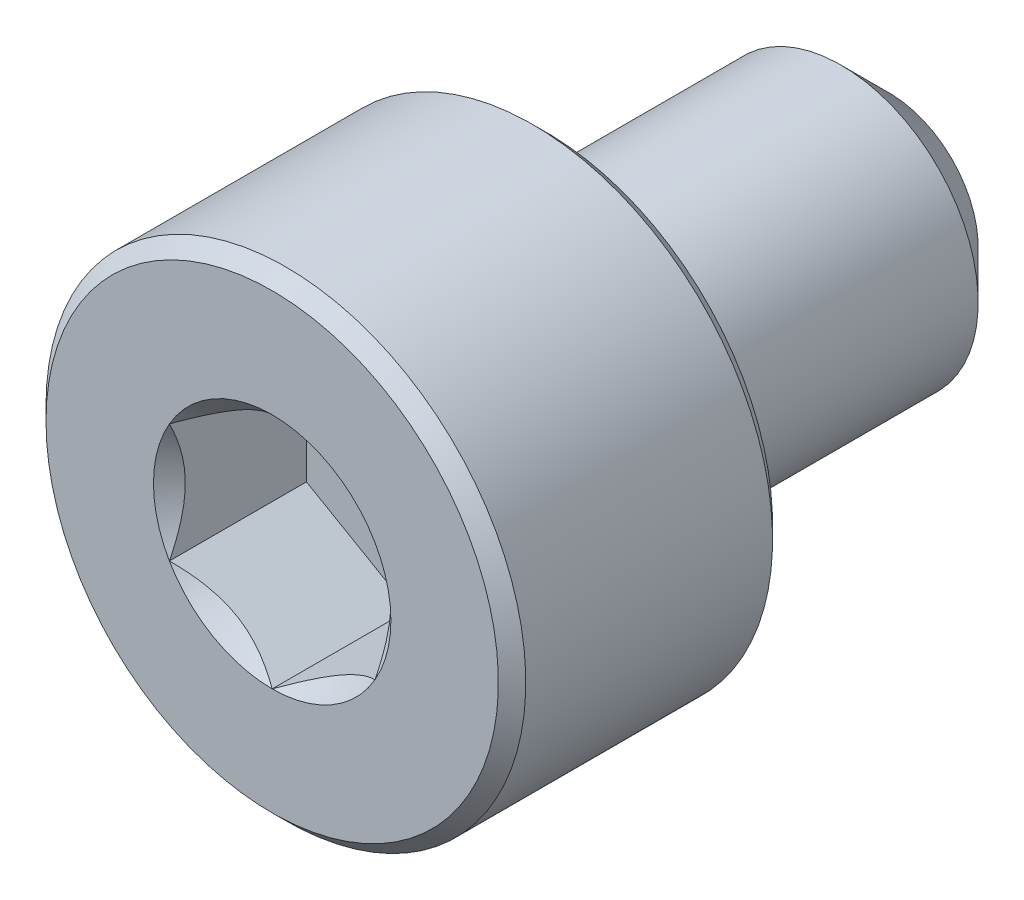
ISO-10303-21;
HEADER;
FILE_DESCRIPTION(('STEP AP214'),'2;1');
FILE_NAME('part.step','',(''),(''),'','','');
FILE_SCHEMA(('AUTOMOTIVE_DESIGN { 1 0 10303 214 1 1 1 1 }'));
ENDSEC;
DATA;
#1=APPLICATION_CONTEXT('core data for automotive mechanical design processes');
#2=APPLICATION_PROTOCOL_DEFINITION('international standard','automotive_design',2000,#1);
#3=PRODUCT_CONTEXT('',#1,'mechanical');
#4=PRODUCT('Part','Part','',(#3));
#5=PRODUCT_RELATED_PRODUCT_CATEGORY('part','',(#4));
#6=PRODUCT_DEFINITION_FORMATION('','',#4);
#7=PRODUCT_DEFINITION_CONTEXT('part definition',#1,'design');
#8=PRODUCT_DEFINITION('design','',#6,#7);
#9=PRODUCT_DEFINITION_SHAPE('','',#8);
#10=(LENGTH_UNIT() NAMED_UNIT(*) SI_UNIT(.MILLI.,.METRE.));
#11=(NAMED_UNIT(*) PLANE_ANGLE_UNIT() SI_UNIT($,.RADIAN.));
#12=(NAMED_UNIT(*) SI_UNIT($,.STERADIAN.) SOLID_ANGLE_UNIT());
#13=UNCERTAINTY_MEASURE_WITH_UNIT(LENGTH_MEASURE(1.E-05),#10,'distance_accuracy_value','');
#14=(GEOMETRIC_REPRESENTATION_CONTEXT(3) GLOBAL_UNCERTAINTY_ASSIGNED_CONTEXT((#13)) GLOBAL_UNIT_ASSIGNED_CONTEXT((#10,
#11,#12)) REPRESENTATION_CONTEXT('',''));
#15=CARTESIAN_POINT('',(0.,0.,0.));
#16=DIRECTION('',(0.,0.,1.));
#17=DIRECTION('',(1.,0.,0.));
#18=AXIS2_PLACEMENT_3D('',#15,#16,#17);
#19=CARTESIAN_POINT('',(0.,3.3,4.5));
#20=DIRECTION('',(0.,0.,1.));
#21=DIRECTION('',(1.,0.,0.));
#22=AXIS2_PLACEMENT_3D('',#19,#20,#21);
#23=PLANE('',#22);
#24=CARTESIAN_POINT('',(0.,0.,4.5));
#25=DIRECTION('',(0.,0.,1.));
#26=DIRECTION('',(1.,0.,0.));
#27=AXIS2_PLACEMENT_3D('',#24,#25,#26);
#28=CIRCLE('',#27,1.73205080756888);
#29=CARTESIAN_POINT('',(1.5,0.86602540378444,4.5));
#30=VERTEX_POINT('',#29);
#31=CARTESIAN_POINT('',(0.,1.73205080756888,4.5));
#32=VERTEX_POINT('',#31);
#33=EDGE_CURVE('E95',#30,#32,#28,.T.);
#34=ORIENTED_EDGE('',*,*,#33,.F.);
#35=CARTESIAN_POINT('',(1.5,-0.86602540378444,4.5));
#36=VERTEX_POINT('',#35);
#37=EDGE_CURVE('E55',#36,#30,#28,.T.);
#38=ORIENTED_EDGE('',*,*,#37,.F.);
#39=CARTESIAN_POINT('',(0.,-1.73205080756888,4.5));
#40=VERTEX_POINT('',#39);
#41=EDGE_CURVE('E281',#40,#36,#28,.T.);
#42=ORIENTED_EDGE('',*,*,#41,.F.);
#43=CARTESIAN_POINT('',(-1.5,-0.866025403784437,4.5));
#44=VERTEX_POINT('',#43);
#45=EDGE_CURVE('E62',#44,#40,#28,.T.);
#46=ORIENTED_EDGE('',*,*,#45,.F.);
#47=CARTESIAN_POINT('',(-1.5,0.86602540378444,4.5));
#48=VERTEX_POINT('',#47);
#49=EDGE_CURVE('E131',#48,#44,#28,.T.);
#50=ORIENTED_EDGE('',*,*,#49,.F.);
#51=EDGE_CURVE('E104',#32,#48,#28,.T.);
#52=ORIENTED_EDGE('',*,*,#51,.F.);
#53=EDGE_LOOP('',(#34,#38,#42,#46,#50,#52));
#54=FACE_BOUND('',#53,.T.);
#55=CARTESIAN_POINT('',(0.,0.,4.5));
#56=DIRECTION('',(0.,0.,-1.));
#57=DIRECTION('',(-1.,0.,0.));
#58=AXIS2_PLACEMENT_3D('',#55,#56,#57);
#59=CIRCLE('',#58,3.3);
#60=CARTESIAN_POINT('',(-3.3,0.,4.5));
#61=VERTEX_POINT('',#60);
#62=EDGE_CURVE('E49',#61,#61,#59,.T.);
#63=ORIENTED_EDGE('',*,*,#62,.F.);
#64=EDGE_LOOP('',(#63));
#65=FACE_BOUND('',#64,.T.);
#66=ADVANCED_FACE('F36',(#54,#65),#23,.T.);
#67=CARTESIAN_POINT('',(0.,0.,4.3));
#68=DIRECTION('',(0.,0.,-1.));
#69=DIRECTION('',(-1.,0.,0.));
#70=AXIS2_PLACEMENT_3D('',#67,#68,#69);
#71=CONICAL_SURFACE('',#70,3.5,0.785398163397452);
#72=ORIENTED_EDGE('',*,*,#62,.T.);
#73=EDGE_LOOP('',(#72));
#74=FACE_BOUND('',#73,.T.);
#75=CARTESIAN_POINT('',(0.,0.,4.3));
#76=DIRECTION('',(0.,0.,-1.));
#77=DIRECTION('',(-1.,0.,0.));
#78=AXIS2_PLACEMENT_3D('',#75,#76,#77);
#79=CIRCLE('',#78,3.5);
#80=CARTESIAN_POINT('',(-3.5,0.,4.3));
#81=VERTEX_POINT('',#80);
#82=EDGE_CURVE('E215',#81,#81,#79,.T.);
#83=ORIENTED_EDGE('',*,*,#82,.F.);
#84=EDGE_LOOP('',(#83));
#85=FACE_BOUND('',#84,.T.);
#86=ADVANCED_FACE('F220',(#74,#85),#71,.T.);
#87=CARTESIAN_POINT('',(0.,0.,-4.5));
#88=DIRECTION('',(0.,0.,-1.));
#89=DIRECTION('',(-1.,0.,0.));
#90=AXIS2_PLACEMENT_3D('',#87,#88,#89);
#91=CYLINDRICAL_SURFACE('',#90,3.5);
#92=ORIENTED_EDGE('',*,*,#82,.T.);
#93=EDGE_LOOP('',(#92));
#94=FACE_BOUND('',#93,.T.);
#95=CARTESIAN_POINT('',(0.,0.,0.700000000000001));
#96=DIRECTION('',(0.,0.,-1.));
#97=DIRECTION('',(-1.,0.,0.));
#98=AXIS2_PLACEMENT_3D('',#95,#96,#97);
#99=CIRCLE('',#98,3.5);
#100=CARTESIAN_POINT('',(-3.5,0.,0.700000000000001));
#101=VERTEX_POINT('',#100);
#102=EDGE_CURVE('E212',#101,#101,#99,.T.);
#103=ORIENTED_EDGE('',*,*,#102,.F.);
#104=EDGE_LOOP('',(#103));
#105=FACE_BOUND('',#104,.T.);
#106=ADVANCED_FACE('F226',(#94,#105),#91,.T.);
#107=CARTESIAN_POINT('',(0.,0.,0.5));
#108=DIRECTION('',(0.,0.,1.));
#109=DIRECTION('',(1.,0.,0.));
#110=AXIS2_PLACEMENT_3D('',#107,#108,#109);
#111=CONICAL_SURFACE('',#110,3.3,0.785398163397448);
#112=ORIENTED_EDGE('',*,*,#102,.T.);
#113=EDGE_LOOP('',(#112));
#114=FACE_BOUND('',#113,.T.);
#115=CARTESIAN_POINT('',(0.,0.,0.5));
#116=DIRECTION('',(0.,0.,-1.));
#117=DIRECTION('',(-1.,0.,0.));
#118=AXIS2_PLACEMENT_3D('',#115,#116,#117);
#119=CIRCLE('',#118,3.3);
#120=CARTESIAN_POINT('',(-3.3,0.,0.5));
#121=VERTEX_POINT('',#120);
#122=EDGE_CURVE('E209',#121,#121,#119,.T.);
#123=ORIENTED_EDGE('',*,*,#122,.F.);
#124=EDGE_LOOP('',(#123));
#125=FACE_BOUND('',#124,.T.);
#126=ADVANCED_FACE('F230',(#114,#125),#111,.T.);
#127=CARTESIAN_POINT('',(0.,3.3,0.5));
#128=DIRECTION('',(0.,0.,-1.));
#129=DIRECTION('',(-1.,0.,0.));
#130=AXIS2_PLACEMENT_3D('',#127,#128,#129);
#131=PLANE('',#130);
#132=ORIENTED_EDGE('',*,*,#122,.T.);
#133=EDGE_LOOP('',(#132));
#134=FACE_BOUND('',#133,.T.);
#135=CARTESIAN_POINT('',(0.,0.,0.5));
#136=DIRECTION('',(0.,0.,-1.));
#137=DIRECTION('',(-1.,0.,0.));
#138=AXIS2_PLACEMENT_3D('',#135,#136,#137);
#139=CIRCLE('',#138,2.);
#140=CARTESIAN_POINT('',(-2.,0.,0.5));
#141=VERTEX_POINT('',#140);
#142=EDGE_CURVE('E206',#141,#141,#139,.T.);
#143=ORIENTED_EDGE('',*,*,#142,.F.);
#144=EDGE_LOOP('',(#143));
#145=FACE_BOUND('',#144,.T.);
#146=ADVANCED_FACE('F236',(#134,#145),#131,.T.);
#147=CARTESIAN_POINT('',(0.,0.,-4.5));
#148=DIRECTION('',(0.,0.,-1.));
#149=DIRECTION('',(-1.,0.,0.));
#150=AXIS2_PLACEMENT_3D('',#147,#148,#149);
#151=CYLINDRICAL_SURFACE('',#150,2.);
#152=ORIENTED_EDGE('',*,*,#142,.T.);
#153=EDGE_LOOP('',(#152));
#154=FACE_BOUND('',#153,.T.);
#155=CARTESIAN_POINT('',(0.,0.,-3.79999999999999));
#156=DIRECTION('',(0.,0.,-1.));
#157=DIRECTION('',(-1.,0.,0.));
#158=AXIS2_PLACEMENT_3D('',#155,#156,#157);
#159=CIRCLE('',#158,2.);
#160=CARTESIAN_POINT('',(-2.,0.,-3.79999999999999));
#161=VERTEX_POINT('',#160);
#162=EDGE_CURVE('E203',#161,#161,#159,.T.);
#163=ORIENTED_EDGE('',*,*,#162,.F.);
#164=EDGE_LOOP('',(#163));
#165=FACE_BOUND('',#164,.T.);
#166=ADVANCED_FACE('F240',(#154,#165),#151,.T.);
#167=CARTESIAN_POINT('',(0.,0.,-4.5));
#168=DIRECTION('',(0.,0.,1.));
#169=DIRECTION('',(1.,0.,0.));
#170=AXIS2_PLACEMENT_3D('',#167,#168,#169);
#171=CONICAL_SURFACE('',#170,1.3,0.785398163397443);
#172=ORIENTED_EDGE('',*,*,#162,.T.);
#173=EDGE_LOOP('',(#172));
#174=FACE_BOUND('',#173,.T.);
#175=CARTESIAN_POINT('',(0.,0.,-4.5));
#176=DIRECTION('',(0.,0.,-1.));
#177=DIRECTION('',(-1.,0.,0.));
#178=AXIS2_PLACEMENT_3D('',#175,#176,#177);
#179=CIRCLE('',#178,1.3);
#180=CARTESIAN_POINT('',(-1.3,0.,-4.5));
#181=VERTEX_POINT('',#180);
#182=EDGE_CURVE('E191',#181,#181,#179,.T.);
#183=ORIENTED_EDGE('',*,*,#182,.F.);
#184=EDGE_LOOP('',(#183));
#185=FACE_BOUND('',#184,.T.);
#186=ADVANCED_FACE('F243',(#174,#185),#171,.T.);
#187=CARTESIAN_POINT('',(0.,1.3,-4.5));
#188=DIRECTION('',(0.,0.,-1.));
#189=DIRECTION('',(-1.,0.,0.));
#190=AXIS2_PLACEMENT_3D('',#187,#188,#189);
#191=PLANE('',#190);
#192=ORIENTED_EDGE('',*,*,#182,.T.);
#193=EDGE_LOOP('',(#192));
#194=FACE_BOUND('',#193,.T.);
#195=ADVANCED_FACE('F164',(#194),#191,.T.);
#196=CARTESIAN_POINT('',(0.,0.,4.5));
#197=DIRECTION('',(0.,0.,1.));
#198=DIRECTION('',(1.,0.,0.));
#199=AXIS2_PLACEMENT_3D('',#196,#197,#198);
#200=CONICAL_SURFACE('',#199,1.73205080756888,0.78539816339745);
#201=ORIENTED_EDGE('',*,*,#51,.T.);
#202=CARTESIAN_POINT('',(0.000200000000000415,1.73216627762272,4.50011548160007));
#203=CARTESIAN_POINT('',(-0.0513677907370752,1.70239359975915,4.47036547606733));
#204=CARTESIAN_POINT('',(-0.1037979176652,1.67212305186355,4.44236248391031));
#205=CARTESIAN_POINT('',(-0.210709034055596,1.61039789003619,4.39108923044014));
#206=CARTESIAN_POINT('',(-0.265200195814661,1.57893740312614,4.36784750504437));
#207=CARTESIAN_POINT('',(-0.375079081357248,1.51549879897987,4.32803372899222));
#208=CARTESIAN_POINT('',(-0.430438809095199,1.4835368452681,4.3113615856709));
#209=CARTESIAN_POINT('',(-0.54237725747715,1.41890915196211,4.2856744568181));
#210=CARTESIAN_POINT('',(-0.598952556553008,1.38624538781118,4.27664029047887));
#211=CARTESIAN_POINT('',(-0.69645538951644,1.329952100953,4.26848908122685));
#212=CARTESIAN_POINT('',(-0.737256908280466,1.30639533311124,4.26728225298922));
#213=CARTESIAN_POINT('',(-0.818787969615858,1.25932335290193,4.26931405716227));
#214=CARTESIAN_POINT('',(-0.85951749431463,1.23580815085313,4.27255367074831));
#215=CARTESIAN_POINT('',(-0.940584402163416,1.18900414978427,4.28329198598196));
#216=CARTESIAN_POINT('',(-0.980921384598288,1.1657155821172,4.29079465301873));
#217=CARTESIAN_POINT('',(-1.06091833691403,1.11952932016335,4.30965161192829));
#218=CARTESIAN_POINT('',(-1.10057800851621,1.09663179808786,4.32100755701859));
#219=CARTESIAN_POINT('',(-1.20216313477448,1.03798159809698,4.35472164759267));
#220=CARTESIAN_POINT('',(-1.26345855370969,1.00259267147465,4.37962184909337));
#221=CARTESIAN_POINT('',(-1.35358562846331,0.950557780604375,4.42165665327158));
#222=CARTESIAN_POINT('',(-1.38328513990772,0.933410759677148,4.4364251535591));
#223=CARTESIAN_POINT('',(-1.44213790138375,0.899432101996407,4.46731056594017));
#224=CARTESIAN_POINT('',(-1.47129140422064,0.88260031928571,4.48342683412171));
#225=CARTESIAN_POINT('',(-1.5002,0.865909933730601,4.50011548160007));
#226=B_SPLINE_CURVE_WITH_KNOTS('',3,(#202,#203,#204,#205,#206,#207,#208,#209,#210,#211,#212,
#213,#214,#215,#216,#217,#218,#219,#220,#221,#222,#223,#224,#225),.UNSPECIFIED.,.F.,.F.,(4,2,2,
2,2,2,2,2,2,2,2,4),(0.,0.199829143693305,0.400822987382389,0.598623720538181,0.795926240188889,
0.937113067959881,1.07833105577193,1.21968061668222,1.36109089931054,1.58570969637565,
1.69770705470964,1.80965120737194),.UNSPECIFIED.);
#227=EDGE_CURVE('E11',#32,#48,#226,.T.);
#228=ORIENTED_EDGE('',*,*,#227,.F.);
#229=EDGE_LOOP('',(#201,#228));
#230=FACE_BOUND('',#229,.T.);
#231=ADVANCED_FACE('F108',(#230),#200,.F.);
#232=ORIENTED_EDGE('',*,*,#49,.T.);
#233=CARTESIAN_POINT('',(-1.5,-1.70094076570699,5.03581150933748));
#234=CARTESIAN_POINT('',(-1.5,-1.65940339844307,5.00466245356307));
#235=CARTESIAN_POINT('',(-1.5,-1.61763176138548,4.97382664603814));
#236=CARTESIAN_POINT('',(-1.5,-1.53352581710889,4.91291005817041));
#237=CARTESIAN_POINT('',(-1.5,-1.49119136858461,4.88282947313436));
#238=CARTESIAN_POINT('',(-1.5,-1.36258344501966,4.79348482963313));
#239=CARTESIAN_POINT('',(-1.5,-1.27533705988673,4.73559781348778));
#240=CARTESIAN_POINT('',(-1.5,-1.09255216894207,4.62219567429685));
#241=CARTESIAN_POINT('',(-1.5,-0.996821581803492,4.56698654757307));
#242=CARTESIAN_POINT('',(-1.5,-0.800613082291591,4.4661637894456));
#243=CARTESIAN_POINT('',(-1.5,-0.700152604862087,4.42051785177961));
#244=CARTESIAN_POINT('',(-1.5,-0.549105960820994,4.36468252969871));
#245=CARTESIAN_POINT('',(-1.5,-0.50070074362804,4.34861439232622));
#246=CARTESIAN_POINT('',(-1.5,-0.40274469507941,4.32036772251469));
#247=CARTESIAN_POINT('',(-1.5,-0.353193782853662,4.30818946555124));
#248=CARTESIAN_POINT('',(-1.5,-0.254057869430008,4.28855091399036));
#249=CARTESIAN_POINT('',(-1.5,-0.204488814603775,4.28101136158588));
#250=CARTESIAN_POINT('',(-1.5,-0.104849462627796,4.27079321692886));
#251=CARTESIAN_POINT('',(-1.5,-0.054779247575758,4.26811384119743));
#252=CARTESIAN_POINT('',(-1.5,0.043673722908844,4.26780462686181));
#253=CARTESIAN_POINT('',(-1.5,0.0920560164094804,4.27000633072589));
#254=CARTESIAN_POINT('',(-1.5,0.188397733218518,4.27897258823616));
#255=CARTESIAN_POINT('',(-1.5,0.236357072029982,4.28573803359405));
#256=CARTESIAN_POINT('',(-1.5,0.332310053939587,4.30358163901288));
#257=CARTESIAN_POINT('',(-1.5,0.380290051019947,4.31473209678684));
#258=CARTESIAN_POINT('',(-1.5,0.475204866701384,4.34076106187732));
#259=CARTESIAN_POINT('',(-1.5,0.52213978119671,4.35563922560084));
#260=CARTESIAN_POINT('',(-1.5,0.671135849237721,4.40843439268167));
#261=CARTESIAN_POINT('',(-1.5,0.771043708402958,4.45241449643641));
#262=CARTESIAN_POINT('',(-1.5,0.96615432077171,4.55016194816059));
#263=CARTESIAN_POINT('',(-1.5,1.06133841027248,4.60396471049644));
#264=CARTESIAN_POINT('',(-1.5,1.24322962123133,4.71492426634355));
#265=CARTESIAN_POINT('',(-1.5,1.33012275327054,4.77177988846287));
#266=CARTESIAN_POINT('',(-1.5,1.45814294533514,4.85965573982338));
#267=CARTESIAN_POINT('',(-1.5,1.50026316125082,4.88925424362582));
#268=CARTESIAN_POINT('',(-1.5,1.58392901779071,4.94922957252824));
#269=CARTESIAN_POINT('',(-1.5,1.62547481197907,4.97960618316485));
#270=CARTESIAN_POINT('',(-1.5,1.66678158585385,5.01030528702036));
#271=B_SPLINE_CURVE_WITH_KNOTS('',3,(#233,#234,#235,#236,#237,#238,#239,#240,#241,#242,#243,
#244,#245,#246,#247,#248,#249,#250,#251,#252,#253,#254,#255,#256,#257,#258,#259,#260,#261,#262,
#263,#264,#265,#266,#267,#268,#269,#270),.UNSPECIFIED.,.F.,.F.,(4,2,2,2,2,2,2,2,2,2,2,2,2,2,2,2,
2,2,4),(0.,0.155753948201002,0.311547769199354,0.625513832410582,0.956763614654479,
1.28687565594417,1.43975300144579,1.59264117109685,1.74283872260253,1.89301205954152,
2.03808349452257,2.1831832832956,2.33078307442231,2.47836926586908,2.80488410158813,
3.13260026706957,3.44396956433299,3.59840353500356,3.75279538879849),.UNSPECIFIED.);
#272=EDGE_CURVE('E103',#48,#44,#271,.F.);
#273=ORIENTED_EDGE('',*,*,#272,.F.);
#274=EDGE_LOOP('',(#232,#273));
#275=FACE_BOUND('',#274,.T.);
#276=ADVANCED_FACE('F258',(#275),#200,.F.);
#277=ORIENTED_EDGE('',*,*,#45,.T.);
#278=CARTESIAN_POINT('',(-1.5002,-0.865909933730601,4.50011548160007));
#279=CARTESIAN_POINT('',(-1.44863220926292,-0.895682611594166,4.47036547606733));
#280=CARTESIAN_POINT('',(-1.3962020823348,-0.925953159489765,4.44236248391031));
#281=CARTESIAN_POINT('',(-1.2892909659444,-0.987678321317124,4.39108923044014));
#282=CARTESIAN_POINT('',(-1.23479980418534,-1.01913880822717,4.36784750504437));
#283=CARTESIAN_POINT('',(-1.12492091864275,-1.08257741237344,4.32803372899222));
#284=CARTESIAN_POINT('',(-1.0695611909048,-1.11453936608521,4.3113615856709));
#285=CARTESIAN_POINT('',(-0.95762274252285,-1.1791670593912,4.2856744568181));
#286=CARTESIAN_POINT('',(-0.901047443446992,-1.21183082354213,4.27664029047887));
#287=CARTESIAN_POINT('',(-0.80354461048356,-1.26812411040032,4.26848908122685));
#288=CARTESIAN_POINT('',(-0.762743091719535,-1.29168087824208,4.26728225298922));
#289=CARTESIAN_POINT('',(-0.681212030384143,-1.33875285845138,4.26931405716227));
#290=CARTESIAN_POINT('',(-0.640482505685371,-1.36226806050018,4.27255367074831));
#291=CARTESIAN_POINT('',(-0.559415597836585,-1.40907206156905,4.28329198598196));
#292=CARTESIAN_POINT('',(-0.519078615401713,-1.43236062923612,4.29079465301873));
#293=CARTESIAN_POINT('',(-0.439081663085971,-1.47854689118996,4.30965161192829));
#294=CARTESIAN_POINT('',(-0.399421991483793,-1.50144441326545,4.32100755701859));
#295=CARTESIAN_POINT('',(-0.297836865225516,-1.56009461325633,4.35472164759267));
#296=CARTESIAN_POINT('',(-0.236541446290312,-1.59548353987866,4.37962184909337));
#297=CARTESIAN_POINT('',(-0.146414371536687,-1.64751843074894,4.42165665327158));
#298=CARTESIAN_POINT('',(-0.116714860092283,-1.66466545167617,4.4364251535591));
#299=CARTESIAN_POINT('',(-0.0578620986162492,-1.69864410935691,4.46731056594017));
#300=CARTESIAN_POINT('',(-0.028708595779363,-1.71547589206761,4.48342683412171));
#301=CARTESIAN_POINT('',(0.000199999999999664,-1.73216627762272,4.50011548160007));
#302=B_SPLINE_CURVE_WITH_KNOTS('',3,(#278,#279,#280,#281,#282,#283,#284,#285,#286,#287,#288,
#289,#290,#291,#292,#293,#294,#295,#296,#297,#298,#299,#300,#301),.UNSPECIFIED.,.F.,.F.,(4,2,2,
2,2,2,2,2,2,2,2,4),(0.,0.199829143693305,0.400822987382389,0.59862372053818,0.795926240188889,
0.93711306795988,1.07833105577193,1.21968061668222,1.36109089931054,1.58570969637565,
1.69770705470964,1.80965120737194),.UNSPECIFIED.);
#303=EDGE_CURVE('E140',#44,#40,#302,.T.);
#304=ORIENTED_EDGE('',*,*,#303,.F.);
#305=EDGE_LOOP('',(#277,#304));
#306=FACE_BOUND('',#305,.T.);
#307=ADVANCED_FACE('F262',(#306),#200,.F.);
#308=ORIENTED_EDGE('',*,*,#41,.T.);
#309=CARTESIAN_POINT('',(-0.000200000000000533,-1.73216627762272,4.50011548160007));
#310=CARTESIAN_POINT('',(0.0513677907370751,-1.70239359975915,4.47036547606733));
#311=CARTESIAN_POINT('',(0.1037979176652,-1.67212305186355,4.44236248391031));
#312=CARTESIAN_POINT('',(0.210709034055596,-1.61039789003619,4.39108923044014));
#313=CARTESIAN_POINT('',(0.265200195814661,-1.57893740312614,4.36784750504437));
#314=CARTESIAN_POINT('',(0.375079081357248,-1.51549879897987,4.32803372899222));
#315=CARTESIAN_POINT('',(0.430438809095199,-1.4835368452681,4.3113615856709));
#316=CARTESIAN_POINT('',(0.54237725747715,-1.41890915196211,4.2856744568181));
#317=CARTESIAN_POINT('',(0.598952556553008,-1.38624538781118,4.27664029047887));
#318=CARTESIAN_POINT('',(0.696455389516441,-1.329952100953,4.26848908122685));
#319=CARTESIAN_POINT('',(0.737256908280466,-1.30639533311124,4.26728225298922));
#320=CARTESIAN_POINT('',(0.818787969615858,-1.25932335290193,4.26931405716227));
#321=CARTESIAN_POINT('',(0.85951749431463,-1.23580815085313,4.27255367074831));
#322=CARTESIAN_POINT('',(0.940584402163416,-1.18900414978427,4.28329198598196));
#323=CARTESIAN_POINT('',(0.980921384598288,-1.1657155821172,4.29079465301873));
#324=CARTESIAN_POINT('',(1.06091833691403,-1.11952932016335,4.30965161192829));
#325=CARTESIAN_POINT('',(1.10057800851621,-1.09663179808786,4.32100755701859));
#326=CARTESIAN_POINT('',(1.20216313477448,-1.03798159809698,4.35472164759267));
#327=CARTESIAN_POINT('',(1.26345855370969,-1.00259267147465,4.37962184909337));
#328=CARTESIAN_POINT('',(1.35358562846331,-0.950557780604375,4.42165665327158));
#329=CARTESIAN_POINT('',(1.38328513990772,-0.933410759677148,4.4364251535591));
#330=CARTESIAN_POINT('',(1.44213790138375,-0.899432101996408,4.46731056594017));
#331=CARTESIAN_POINT('',(1.47129140422064,-0.882600319285711,4.48342683412171));
#332=CARTESIAN_POINT('',(1.5002,-0.865909933730602,4.50011548160007));
#333=B_SPLINE_CURVE_WITH_KNOTS('',3,(#309,#310,#311,#312,#313,#314,#315,#316,#317,#318,#319,
#320,#321,#322,#323,#324,#325,#326,#327,#328,#329,#330,#331,#332),.UNSPECIFIED.,.F.,.F.,(4,2,2,
2,2,2,2,2,2,2,2,4),(0.,0.199829143693305,0.400822987382389,0.598623720538181,0.79592624018889,
0.937113067959882,1.07833105577193,1.21968061668222,1.36109089931054,1.58570969637565,
1.69770705470964,1.80965120737194),.UNSPECIFIED.);
#334=EDGE_CURVE('E283',#40,#36,#333,.T.);
#335=ORIENTED_EDGE('',*,*,#334,.F.);
#336=EDGE_LOOP('',(#308,#335));
#337=FACE_BOUND('',#336,.T.);
#338=ADVANCED_FACE('F271',(#337),#200,.F.);
#339=ORIENTED_EDGE('',*,*,#37,.T.);
#340=CARTESIAN_POINT('',(1.5,-1.70094076506827,5.03581150885843));
#341=CARTESIAN_POINT('',(1.5,-1.65940339782208,5.00466245310244));
#342=CARTESIAN_POINT('',(1.5,-1.61763176078228,4.97382664559589));
#343=CARTESIAN_POINT('',(1.5,-1.53352581654146,4.91291005776482));
#344=CARTESIAN_POINT('',(1.5,-1.49119136803515,4.88282947274705));
#345=CARTESIAN_POINT('',(1.5,-1.36258344452521,4.79348482930099));
#346=CARTESIAN_POINT('',(1.5,-1.2753370594297,4.73559781319227));
#347=CARTESIAN_POINT('',(1.5,-1.09255216856664,4.6221956740766));
#348=CARTESIAN_POINT('',(1.5,-0.996821581472455,4.56698654739118));
#349=CARTESIAN_POINT('',(1.5,-0.800613082053126,4.46616378933479));
#350=CARTESIAN_POINT('',(1.5,-0.70015260467177,4.42051785170157));
#351=CARTESIAN_POINT('',(1.5,-0.549105960667007,4.36468252964533));
#352=CARTESIAN_POINT('',(1.5,-0.500700743459033,4.3486143922722));
#353=CARTESIAN_POINT('',(1.5,-0.402744694879906,4.32036772246244));
#354=CARTESIAN_POINT('',(1.5,-0.353193782638679,4.30818946550141));
#355=CARTESIAN_POINT('',(1.5,-0.254057869184595,4.28855091394885));
#356=CARTESIAN_POINT('',(1.5,-0.204488814343416,4.28101136155019));
#357=CARTESIAN_POINT('',(1.5,-0.104849462338082,4.27079321690814));
#358=CARTESIAN_POINT('',(1.5,-0.0547792472716355,4.26811384118586));
#359=CARTESIAN_POINT('',(1.5,0.043673723240303,4.26780462687103));
#360=CARTESIAN_POINT('',(1.5,0.0920560167539032,4.27000633074664));
#361=CARTESIAN_POINT('',(1.5,0.188397733587633,4.27897258828183));
#362=CARTESIAN_POINT('',(1.5,0.236357072410824,4.28573803365309));
#363=CARTESIAN_POINT('',(1.5,0.332310054343575,4.30358163910001));
#364=CARTESIAN_POINT('',(1.5,0.380290051435318,4.31473209688875));
#365=CARTESIAN_POINT('',(1.5,0.475204867138458,4.34076106200917));
#366=CARTESIAN_POINT('',(1.5,0.522139781644104,4.35563922574786));
#367=CARTESIAN_POINT('',(1.5,0.671135849783409,4.40843439290061));
#368=CARTESIAN_POINT('',(1.5,0.77104370903169,4.4524144967216));
#369=CARTESIAN_POINT('',(1.5,0.966154321560161,4.55016194858557));
#370=CARTESIAN_POINT('',(1.5,1.06133841113756,4.603964710995));
#371=CARTESIAN_POINT('',(1.5,1.24322962223427,4.71492426698296));
#372=CARTESIAN_POINT('',(1.5,1.33012275433518,4.7717798891689));
#373=CARTESIAN_POINT('',(1.5,1.45814294649102,4.85965574062901));
#374=CARTESIAN_POINT('',(1.5,1.50026316243668,4.88925424446438));
#375=CARTESIAN_POINT('',(1.5,1.58392901903632,4.94922957343262));
#376=CARTESIAN_POINT('',(1.5,1.62547481325447,4.97960618410212));
#377=CARTESIAN_POINT('',(1.5,1.66678158715899,5.01030528799048));
#378=B_SPLINE_CURVE_WITH_KNOTS('',3,(#340,#341,#342,#343,#344,#345,#346,#347,#348,#349,#350,
#351,#352,#353,#354,#355,#356,#357,#358,#359,#360,#361,#362,#363,#364,#365,#366,#367,#368,#369,
#370,#371,#372,#373,#374,#375,#376,#377),.UNSPECIFIED.,.F.,.F.,(4,2,2,2,2,2,2,2,2,2,2,2,2,2,2,2,
2,2,4),(0.,0.155753948125308,0.311547769047944,0.625513832104916,0.956763614176022,
1.28687565529455,1.43975300083938,1.59264117053358,1.74283872208071,1.89301205906115,
2.03808349408246,2.18318328289586,2.33078307406584,2.47836926555587,2.80488410158167,
3.1326002673719,3.44396956489969,3.59840353570064,3.75279538962596),.UNSPECIFIED.);
#379=EDGE_CURVE('E120',#36,#30,#378,.T.);
#380=ORIENTED_EDGE('',*,*,#379,.F.);
#381=EDGE_LOOP('',(#339,#380));
#382=FACE_BOUND('',#381,.T.);
#383=ADVANCED_FACE('F265',(#382),#200,.F.);
#384=ORIENTED_EDGE('',*,*,#33,.T.);
#385=CARTESIAN_POINT('',(1.5002,0.865909933730602,4.50011548160007));
#386=CARTESIAN_POINT('',(1.44863220926292,0.895682611594167,4.47036547606733));
#387=CARTESIAN_POINT('',(1.3962020823348,0.925953159489766,4.44236248391031));
#388=CARTESIAN_POINT('',(1.2892909659444,0.987678321317125,4.39108923044014));
#389=CARTESIAN_POINT('',(1.23479980418534,1.01913880822718,4.36784750504437));
#390=CARTESIAN_POINT('',(1.12492091864275,1.08257741237344,4.32803372899222));
#391=CARTESIAN_POINT('',(1.0695611909048,1.11453936608522,4.3113615856709));
#392=CARTESIAN_POINT('',(0.957622742522849,1.1791670593912,4.2856744568181));
#393=CARTESIAN_POINT('',(0.901047443446991,1.21183082354213,4.27664029047887));
#394=CARTESIAN_POINT('',(0.803544610483559,1.26812411040032,4.26848908122685));
#395=CARTESIAN_POINT('',(0.762743091719533,1.29168087824208,4.26728225298922));
#396=CARTESIAN_POINT('',(0.681212030384141,1.33875285845138,4.26931405716227));
#397=CARTESIAN_POINT('',(0.64048250568537,1.36226806050018,4.27255367074831));
#398=CARTESIAN_POINT('',(0.559415597836584,1.40907206156905,4.28329198598196));
#399=CARTESIAN_POINT('',(0.519078615401712,1.43236062923612,4.29079465301873));
#400=CARTESIAN_POINT('',(0.439081663085969,1.47854689118997,4.30965161192829));
#401=CARTESIAN_POINT('',(0.399421991483792,1.50144441326545,4.32100755701859));
#402=CARTESIAN_POINT('',(0.297836865225515,1.56009461325633,4.35472164759267));
#403=CARTESIAN_POINT('',(0.236541446290311,1.59548353987866,4.37962184909337));
#404=CARTESIAN_POINT('',(0.146414371536686,1.64751843074894,4.42165665327158));
#405=CARTESIAN_POINT('',(0.116714860092282,1.66466545167617,4.4364251535591));
#406=CARTESIAN_POINT('',(0.057862098616249,1.69864410935691,4.46731056594017));
#407=CARTESIAN_POINT('',(0.0287085957793628,1.71547589206761,4.48342683412171));
#408=CARTESIAN_POINT('',(-0.000199999999999924,1.73216627762272,4.50011548160007));
#409=B_SPLINE_CURVE_WITH_KNOTS('',3,(#385,#386,#387,#388,#389,#390,#391,#392,#393,#394,#395,
#396,#397,#398,#399,#400,#401,#402,#403,#404,#405,#406,#407,#408),.UNSPECIFIED.,.F.,.F.,(4,2,2,
2,2,2,2,2,2,2,2,4),(0.,0.199829143693305,0.400822987382388,0.59862372053818,0.795926240188888,
0.93711306795988,1.07833105577193,1.21968061668222,1.36109089931054,1.58570969637565,
1.69770705470963,1.80965120737194),.UNSPECIFIED.);
#410=EDGE_CURVE('E99',#30,#32,#409,.T.);
#411=ORIENTED_EDGE('',*,*,#410,.F.);
#412=EDGE_LOOP('',(#384,#411));
#413=FACE_BOUND('',#412,.T.);
#414=ADVANCED_FACE('F97',(#413),#200,.F.);
#415=CARTESIAN_POINT('',(0.,0.,2.5));
#416=DIRECTION('',(0.,0.,1.));
#417=DIRECTION('',(1.,0.,0.));
#418=AXIS2_PLACEMENT_3D('',#415,#416,#417);
#419=PLANE('',#418);
#420=DIRECTION('',(-0.866025403784439,0.5,0.));
#421=VECTOR('',#420,1.);
#422=CARTESIAN_POINT('',(1.5,0.86602540378444,2.5));
#423=LINE('',#422,#421);
#424=CARTESIAN_POINT('',(1.5,0.86602540378444,2.5));
#425=VERTEX_POINT('',#424);
#426=CARTESIAN_POINT('',(0.,1.73205080756888,2.5));
#427=VERTEX_POINT('',#426);
#428=EDGE_CURVE('E119',#425,#427,#423,.T.);
#429=ORIENTED_EDGE('',*,*,#428,.T.);
#430=DIRECTION('',(-0.866025403784439,-0.5,0.));
#431=VECTOR('',#430,1.);
#432=CARTESIAN_POINT('',(0.,1.73205080756888,2.5));
#433=LINE('',#432,#431);
#434=CARTESIAN_POINT('',(-1.5,0.866025403784439,2.5));
#435=VERTEX_POINT('',#434);
#436=EDGE_CURVE('E124',#427,#435,#433,.T.);
#437=ORIENTED_EDGE('',*,*,#436,.T.);
#438=DIRECTION('',(0.,-1.,0.));
#439=VECTOR('',#438,1.);
#440=CARTESIAN_POINT('',(-1.5,0.866025403784439,2.5));
#441=LINE('',#440,#439);
#442=CARTESIAN_POINT('',(-1.5,-0.866025403784439,2.5));
#443=VERTEX_POINT('',#442);
#444=EDGE_CURVE('E179',#435,#443,#441,.T.);
#445=ORIENTED_EDGE('',*,*,#444,.T.);
#446=DIRECTION('',(0.866025403784439,-0.5,0.));
#447=VECTOR('',#446,1.);
#448=CARTESIAN_POINT('',(-1.5,-0.866025403784439,2.5));
#449=LINE('',#448,#447);
#450=CARTESIAN_POINT('',(0.,-1.73205080756888,2.5));
#451=VERTEX_POINT('',#450);
#452=EDGE_CURVE('E182',#443,#451,#449,.T.);
#453=ORIENTED_EDGE('',*,*,#452,.T.);
#454=DIRECTION('',(0.866025403784439,0.5,0.));
#455=VECTOR('',#454,1.);
#456=CARTESIAN_POINT('',(0.,-1.73205080756888,2.5));
#457=LINE('',#456,#455);
#458=CARTESIAN_POINT('',(1.5,-0.86602540378444,2.5));
#459=VERTEX_POINT('',#458);
#460=EDGE_CURVE('E185',#451,#459,#457,.T.);
#461=ORIENTED_EDGE('',*,*,#460,.T.);
#462=DIRECTION('',(0.,1.,0.));
#463=VECTOR('',#462,1.);
#464=CARTESIAN_POINT('',(1.5,-0.86602540378444,2.5));
#465=LINE('',#464,#463);
#466=EDGE_CURVE('E127',#459,#425,#465,.T.);
#467=ORIENTED_EDGE('',*,*,#466,.T.);
#468=EDGE_LOOP('',(#429,#437,#445,#453,#461,#467));
#469=FACE_BOUND('',#468,.T.);
#470=ADVANCED_FACE('F159',(#469),#419,.T.);
#471=CARTESIAN_POINT('',(0.,1.73205080756888,2.5));
#472=DIRECTION('',(-0.5,0.866025403784439,0.));
#473=DIRECTION('',(-0.866025403784439,-0.5,0.));
#474=AXIS2_PLACEMENT_3D('',#471,#472,#473);
#475=PLANE('',#474);
#476=DIRECTION('',(0.,0.,1.));
#477=VECTOR('',#476,1.);
#478=CARTESIAN_POINT('',(0.,1.73205080756888,2.5));
#479=LINE('',#478,#477);
#480=EDGE_CURVE('E116',#427,#32,#479,.T.);
#481=ORIENTED_EDGE('',*,*,#480,.T.);
#482=ORIENTED_EDGE('',*,*,#227,.T.);
#483=DIRECTION('',(0.,0.,1.));
#484=VECTOR('',#483,1.);
#485=CARTESIAN_POINT('',(-1.5,0.866025403784439,2.5));
#486=LINE('',#485,#484);
#487=EDGE_CURVE('E126',#435,#48,#486,.T.);
#488=ORIENTED_EDGE('',*,*,#487,.F.);
#489=ORIENTED_EDGE('',*,*,#436,.F.);
#490=EDGE_LOOP('',(#481,#482,#488,#489));
#491=FACE_BOUND('',#490,.T.);
#492=ADVANCED_FACE('F122',(#491),#475,.F.);
#493=CARTESIAN_POINT('',(-1.5,0.866025403784439,2.5));
#494=DIRECTION('',(-1.,0.,0.));
#495=DIRECTION('',(0.,-1.,0.));
#496=AXIS2_PLACEMENT_3D('',#493,#494,#495);
#497=PLANE('',#496);
#498=ORIENTED_EDGE('',*,*,#487,.T.);
#499=ORIENTED_EDGE('',*,*,#272,.T.);
#500=DIRECTION('',(0.,0.,1.));
#501=VECTOR('',#500,1.);
#502=CARTESIAN_POINT('',(-1.5,-0.866025403784439,2.5));
#503=LINE('',#502,#501);
#504=EDGE_CURVE('E197',#443,#44,#503,.T.);
#505=ORIENTED_EDGE('',*,*,#504,.F.);
#506=ORIENTED_EDGE('',*,*,#444,.F.);
#507=EDGE_LOOP('',(#498,#499,#505,#506));
#508=FACE_BOUND('',#507,.T.);
#509=ADVANCED_FACE('F149',(#508),#497,.F.);
#510=CARTESIAN_POINT('',(-1.5,-0.866025403784439,2.5));
#511=DIRECTION('',(-0.5,-0.866025403784439,0.));
#512=DIRECTION('',(0.866025403784439,-0.5,0.));
#513=AXIS2_PLACEMENT_3D('',#510,#511,#512);
#514=PLANE('',#513);
#515=ORIENTED_EDGE('',*,*,#504,.T.);
#516=ORIENTED_EDGE('',*,*,#303,.T.);
#517=DIRECTION('',(0.,0.,1.));
#518=VECTOR('',#517,1.);
#519=CARTESIAN_POINT('',(0.,-1.73205080756888,2.5));
#520=LINE('',#519,#518);
#521=EDGE_CURVE('E194',#451,#40,#520,.T.);
#522=ORIENTED_EDGE('',*,*,#521,.F.);
#523=ORIENTED_EDGE('',*,*,#452,.F.);
#524=EDGE_LOOP('',(#515,#516,#522,#523));
#525=FACE_BOUND('',#524,.T.);
#526=ADVANCED_FACE('F152',(#525),#514,.F.);
#527=CARTESIAN_POINT('',(0.,-1.73205080756888,2.5));
#528=DIRECTION('',(0.5,-0.866025403784439,0.));
#529=DIRECTION('',(0.866025403784439,0.5,0.));
#530=AXIS2_PLACEMENT_3D('',#527,#528,#529);
#531=PLANE('',#530);
#532=ORIENTED_EDGE('',*,*,#521,.T.);
#533=ORIENTED_EDGE('',*,*,#334,.T.);
#534=DIRECTION('',(0.,0.,1.));
#535=VECTOR('',#534,1.);
#536=CARTESIAN_POINT('',(1.5,-0.86602540378444,2.5));
#537=LINE('',#536,#535);
#538=EDGE_CURVE('E192',#459,#36,#537,.T.);
#539=ORIENTED_EDGE('',*,*,#538,.F.);
#540=ORIENTED_EDGE('',*,*,#460,.F.);
#541=EDGE_LOOP('',(#532,#533,#539,#540));
#542=FACE_BOUND('',#541,.T.);
#543=ADVANCED_FACE('F289',(#542),#531,.F.);
#544=CARTESIAN_POINT('',(1.5,-0.86602540378444,2.5));
#545=DIRECTION('',(1.,0.,0.));
#546=DIRECTION('',(0.,0.,-1.));
#547=AXIS2_PLACEMENT_3D('',#544,#545,#546);
#548=PLANE('',#547);
#549=ORIENTED_EDGE('',*,*,#538,.T.);
#550=ORIENTED_EDGE('',*,*,#379,.T.);
#551=DIRECTION('',(0.,0.,1.));
#552=VECTOR('',#551,1.);
#553=CARTESIAN_POINT('',(1.5,0.86602540378444,2.5));
#554=LINE('',#553,#552);
#555=EDGE_CURVE('E118',#425,#30,#554,.T.);
#556=ORIENTED_EDGE('',*,*,#555,.F.);
#557=ORIENTED_EDGE('',*,*,#466,.F.);
#558=EDGE_LOOP('',(#549,#550,#556,#557));
#559=FACE_BOUND('',#558,.T.);
#560=ADVANCED_FACE('F163',(#559),#548,.F.);
#561=CARTESIAN_POINT('',(1.5,0.86602540378444,2.5));
#562=DIRECTION('',(0.5,0.866025403784439,0.));
#563=DIRECTION('',(-0.866025403784439,0.5,0.));
#564=AXIS2_PLACEMENT_3D('',#561,#562,#563);
#565=PLANE('',#564);
#566=ORIENTED_EDGE('',*,*,#555,.T.);
#567=ORIENTED_EDGE('',*,*,#410,.T.);
#568=ORIENTED_EDGE('',*,*,#480,.F.);
#569=ORIENTED_EDGE('',*,*,#428,.F.);
#570=EDGE_LOOP('',(#566,#567,#568,#569));
#571=FACE_BOUND('',#570,.T.);
#572=ADVANCED_FACE('F114',(#571),#565,.F.);
#573=CLOSED_SHELL('',(#66,#86,#106,#126,#146,#166,#186,#195,#231,#276,#307,#338,#383,#414,#470,
#492,#509,#526,#543,#560,#572));
#574=MANIFOLD_SOLID_BREP('B2',#573);
#575=ADVANCED_BREP_SHAPE_REPRESENTATION('',(#18,#574),#14);
#576=SHAPE_DEFINITION_REPRESENTATION(#9,#575);
ENDSEC;
END-ISO-10303-21;
